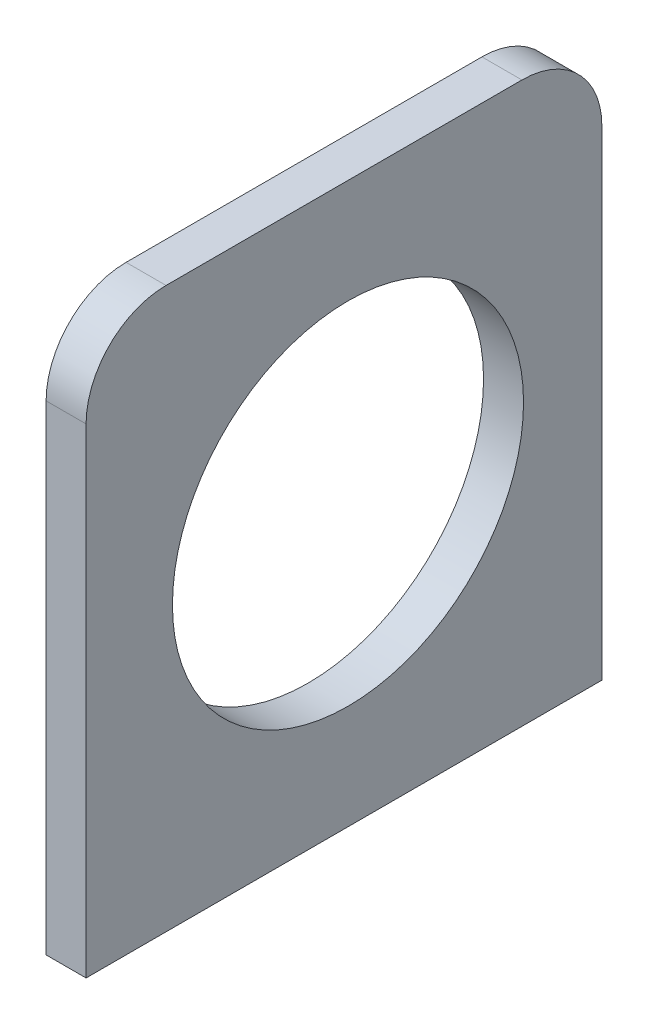
ISO-10303-21;
HEADER;
FILE_DESCRIPTION(('STEP AP214'),'2;1');
FILE_NAME('part.step','',(''),(''),'','','');
FILE_SCHEMA(('AUTOMOTIVE_DESIGN { 1 0 10303 214 1 1 1 1 }'));
ENDSEC;
DATA;
#1=APPLICATION_CONTEXT('core data for automotive mechanical design processes');
#2=APPLICATION_PROTOCOL_DEFINITION('international standard','automotive_design',2000,#1);
#3=PRODUCT_CONTEXT('',#1,'mechanical');
#4=PRODUCT('Part','Part','',(#3));
#5=PRODUCT_RELATED_PRODUCT_CATEGORY('part','',(#4));
#6=PRODUCT_DEFINITION_FORMATION('','',#4);
#7=PRODUCT_DEFINITION_CONTEXT('part definition',#1,'design');
#8=PRODUCT_DEFINITION('design','',#6,#7);
#9=PRODUCT_DEFINITION_SHAPE('','',#8);
#10=(LENGTH_UNIT() NAMED_UNIT(*) SI_UNIT(.MILLI.,.METRE.));
#11=(NAMED_UNIT(*) PLANE_ANGLE_UNIT() SI_UNIT($,.RADIAN.));
#12=(NAMED_UNIT(*) SI_UNIT($,.STERADIAN.) SOLID_ANGLE_UNIT());
#13=UNCERTAINTY_MEASURE_WITH_UNIT(LENGTH_MEASURE(1.E-05),#10,'distance_accuracy_value','');
#14=(GEOMETRIC_REPRESENTATION_CONTEXT(3) GLOBAL_UNCERTAINTY_ASSIGNED_CONTEXT((#13)) GLOBAL_UNIT_ASSIGNED_CONTEXT((#10,
#11,#12)) REPRESENTATION_CONTEXT('',''));
#15=CARTESIAN_POINT('',(0.,0.,0.));
#16=DIRECTION('',(0.,0.,1.));
#17=DIRECTION('',(1.,0.,0.));
#18=AXIS2_PLACEMENT_3D('',#15,#16,#17);
#19=CARTESIAN_POINT('',(-2.76315789473684,-62.8618421052632,64.5));
#20=DIRECTION('',(1.,0.,0.));
#21=DIRECTION('',(0.,1.,0.));
#22=AXIS2_PLACEMENT_3D('',#19,#20,#21);
#23=PLANE('',#22);
#24=CARTESIAN_POINT('',(-2.76315789473684,-27.8618421052632,31.75));
#25=DIRECTION('',(-1.,0.,0.));
#26=DIRECTION('',(0.,-1.,0.));
#27=AXIS2_PLACEMENT_3D('',#24,#25,#26);
#28=CIRCLE('',#27,21.9509271);
#29=CARTESIAN_POINT('',(-2.76315789473684,-49.8127692052632,31.75));
#30=VERTEX_POINT('',#29);
#31=EDGE_CURVE('E164',#30,#30,#28,.T.);
#32=ORIENTED_EDGE('',*,*,#31,.F.);
#33=EDGE_LOOP('',(#32));
#34=FACE_BOUND('',#33,.T.);
#35=DIRECTION('',(0.,0.,-1.));
#36=VECTOR('',#35,1.);
#37=CARTESIAN_POINT('',(-2.76315789473684,7.13815789473684,64.5));
#38=LINE('',#37,#36);
#39=CARTESIAN_POINT('',(-2.76315789473684,7.13815789473684,54.5));
#40=VERTEX_POINT('',#39);
#41=CARTESIAN_POINT('',(-2.76315789473684,7.13815789473684,10.));
#42=VERTEX_POINT('',#41);
#43=EDGE_CURVE('E146',#40,#42,#38,.T.);
#44=ORIENTED_EDGE('',*,*,#43,.T.);
#45=CARTESIAN_POINT('',(-2.76315789473684,-2.86184210526316,10.));
#46=DIRECTION('',(1.,0.,0.));
#47=DIRECTION('',(0.,1.,0.));
#48=AXIS2_PLACEMENT_3D('',#45,#46,#47);
#49=CIRCLE('',#48,10.);
#50=CARTESIAN_POINT('',(-2.76315789473684,-2.86184210526316,0.));
#51=VERTEX_POINT('',#50);
#52=EDGE_CURVE('E62',#42,#51,#49,.F.);
#53=ORIENTED_EDGE('',*,*,#52,.T.);
#54=DIRECTION('',(0.,-1.,0.));
#55=VECTOR('',#54,1.);
#56=CARTESIAN_POINT('',(-2.76315789473684,-62.8618421052632,0.));
#57=LINE('',#56,#55);
#58=CARTESIAN_POINT('',(-2.76315789473684,-62.8618421052632,0.));
#59=VERTEX_POINT('',#58);
#60=EDGE_CURVE('E114',#51,#59,#57,.T.);
#61=ORIENTED_EDGE('',*,*,#60,.T.);
#62=DIRECTION('',(0.,0.,-1.));
#63=VECTOR('',#62,1.);
#64=CARTESIAN_POINT('',(-2.76315789473684,-62.8618421052632,64.5));
#65=LINE('',#64,#63);
#66=CARTESIAN_POINT('',(-2.76315789473684,-62.8618421052632,64.5));
#67=VERTEX_POINT('',#66);
#68=EDGE_CURVE('E107',#67,#59,#65,.T.);
#69=ORIENTED_EDGE('',*,*,#68,.F.);
#70=DIRECTION('',(0.,-1.,0.));
#71=VECTOR('',#70,1.);
#72=CARTESIAN_POINT('',(-2.76315789473684,-62.8618421052632,64.5));
#73=LINE('',#72,#71);
#74=CARTESIAN_POINT('',(-2.76315789473684,-2.86184210526316,64.5));
#75=VERTEX_POINT('',#74);
#76=EDGE_CURVE('E92',#75,#67,#73,.T.);
#77=ORIENTED_EDGE('',*,*,#76,.F.);
#78=CARTESIAN_POINT('',(-2.76315789473684,-2.86184210526316,54.5));
#79=DIRECTION('',(1.,0.,0.));
#80=DIRECTION('',(0.,1.,0.));
#81=AXIS2_PLACEMENT_3D('',#78,#79,#80);
#82=CIRCLE('',#81,10.);
#83=EDGE_CURVE('E120',#75,#40,#82,.F.);
#84=ORIENTED_EDGE('',*,*,#83,.T.);
#85=EDGE_LOOP('',(#44,#53,#61,#69,#77,#84));
#86=FACE_BOUND('',#85,.T.);
#87=ADVANCED_FACE('F38',(#34,#86),#23,.F.);
#88=CARTESIAN_POINT('',(2.23684210526317,-62.8618421052632,64.5));
#89=DIRECTION('',(0.,1.,0.));
#90=DIRECTION('',(0.,0.,1.));
#91=AXIS2_PLACEMENT_3D('',#88,#89,#90);
#92=PLANE('',#91);
#93=DIRECTION('',(1.,0.,0.));
#94=VECTOR('',#93,1.);
#95=CARTESIAN_POINT('',(2.23684210526317,-62.8618421052632,0.));
#96=LINE('',#95,#94);
#97=CARTESIAN_POINT('',(2.23684210526317,-62.8618421052632,0.));
#98=VERTEX_POINT('',#97);
#99=EDGE_CURVE('E159',#59,#98,#96,.T.);
#100=ORIENTED_EDGE('',*,*,#99,.T.);
#101=DIRECTION('',(0.,0.,-1.));
#102=VECTOR('',#101,1.);
#103=CARTESIAN_POINT('',(2.23684210526317,-62.8618421052632,64.5));
#104=LINE('',#103,#102);
#105=CARTESIAN_POINT('',(2.23684210526317,-62.8618421052632,64.5));
#106=VERTEX_POINT('',#105);
#107=EDGE_CURVE('E109',#106,#98,#104,.T.);
#108=ORIENTED_EDGE('',*,*,#107,.F.);
#109=DIRECTION('',(1.,0.,0.));
#110=VECTOR('',#109,1.);
#111=CARTESIAN_POINT('',(2.23684210526317,-62.8618421052632,64.5));
#112=LINE('',#111,#110);
#113=EDGE_CURVE('E96',#67,#106,#112,.T.);
#114=ORIENTED_EDGE('',*,*,#113,.F.);
#115=ORIENTED_EDGE('',*,*,#68,.T.);
#116=EDGE_LOOP('',(#100,#108,#114,#115));
#117=FACE_BOUND('',#116,.T.);
#118=ADVANCED_FACE('F106',(#117),#92,.F.);
#119=CARTESIAN_POINT('',(2.23684210526316,7.13815789473684,64.5));
#120=DIRECTION('',(-1.,0.,0.));
#121=DIRECTION('',(0.,-1.,0.));
#122=AXIS2_PLACEMENT_3D('',#119,#120,#121);
#123=PLANE('',#122);
#124=CARTESIAN_POINT('',(2.23684210526316,-27.8618421052632,31.75));
#125=DIRECTION('',(-1.,0.,0.));
#126=DIRECTION('',(0.,-1.,0.));
#127=AXIS2_PLACEMENT_3D('',#124,#125,#126);
#128=CIRCLE('',#127,21.9509271);
#129=CARTESIAN_POINT('',(2.23684210526317,-49.8127692052632,31.75));
#130=VERTEX_POINT('',#129);
#131=EDGE_CURVE('E42',#130,#130,#128,.T.);
#132=ORIENTED_EDGE('',*,*,#131,.T.);
#133=EDGE_LOOP('',(#132));
#134=FACE_BOUND('',#133,.T.);
#135=DIRECTION('',(0.,1.,0.));
#136=VECTOR('',#135,1.);
#137=CARTESIAN_POINT('',(2.23684210526316,7.13815789473684,0.));
#138=LINE('',#137,#136);
#139=CARTESIAN_POINT('',(2.23684210526316,-2.86184210526316,0.));
#140=VERTEX_POINT('',#139);
#141=EDGE_CURVE('E102',#98,#140,#138,.T.);
#142=ORIENTED_EDGE('',*,*,#141,.T.);
#143=CARTESIAN_POINT('',(2.23684210526316,-2.86184210526316,10.));
#144=DIRECTION('',(-1.,0.,0.));
#145=DIRECTION('',(0.,-1.,0.));
#146=AXIS2_PLACEMENT_3D('',#143,#144,#145);
#147=CIRCLE('',#146,10.);
#148=CARTESIAN_POINT('',(2.23684210526316,7.13815789473684,10.));
#149=VERTEX_POINT('',#148);
#150=EDGE_CURVE('E11',#140,#149,#147,.F.);
#151=ORIENTED_EDGE('',*,*,#150,.T.);
#152=DIRECTION('',(0.,0.,-1.));
#153=VECTOR('',#152,1.);
#154=CARTESIAN_POINT('',(2.23684210526316,7.13815789473684,64.5));
#155=LINE('',#154,#153);
#156=CARTESIAN_POINT('',(2.23684210526316,7.13815789473684,54.5));
#157=VERTEX_POINT('',#156);
#158=EDGE_CURVE('E122',#157,#149,#155,.T.);
#159=ORIENTED_EDGE('',*,*,#158,.F.);
#160=CARTESIAN_POINT('',(2.23684210526316,-2.86184210526316,54.5));
#161=DIRECTION('',(-1.,0.,0.));
#162=DIRECTION('',(0.,-1.,0.));
#163=AXIS2_PLACEMENT_3D('',#160,#161,#162);
#164=CIRCLE('',#163,10.);
#165=CARTESIAN_POINT('',(2.23684210526316,-2.86184210526316,64.5));
#166=VERTEX_POINT('',#165);
#167=EDGE_CURVE('E131',#157,#166,#164,.F.);
#168=ORIENTED_EDGE('',*,*,#167,.T.);
#169=DIRECTION('',(0.,1.,0.));
#170=VECTOR('',#169,1.);
#171=CARTESIAN_POINT('',(2.23684210526316,7.13815789473684,64.5));
#172=LINE('',#171,#170);
#173=EDGE_CURVE('E112',#106,#166,#172,.T.);
#174=ORIENTED_EDGE('',*,*,#173,.F.);
#175=ORIENTED_EDGE('',*,*,#107,.T.);
#176=EDGE_LOOP('',(#142,#151,#159,#168,#174,#175));
#177=FACE_BOUND('',#176,.T.);
#178=ADVANCED_FACE('F173',(#134,#177),#123,.F.);
#179=CARTESIAN_POINT('',(-2.76315789473684,7.13815789473684,64.5));
#180=DIRECTION('',(0.,-1.,0.));
#181=DIRECTION('',(0.,0.,-1.));
#182=AXIS2_PLACEMENT_3D('',#179,#180,#181);
#183=PLANE('',#182);
#184=ORIENTED_EDGE('',*,*,#158,.T.);
#185=DIRECTION('',(-1.,0.,0.));
#186=VECTOR('',#185,1.);
#187=CARTESIAN_POINT('',(-2.76315789473684,7.13815789473684,10.));
#188=LINE('',#187,#186);
#189=EDGE_CURVE('E134',#149,#42,#188,.T.);
#190=ORIENTED_EDGE('',*,*,#189,.T.);
#191=ORIENTED_EDGE('',*,*,#43,.F.);
#192=DIRECTION('',(-1.,0.,0.));
#193=VECTOR('',#192,1.);
#194=CARTESIAN_POINT('',(-2.76315789473684,7.13815789473684,54.5));
#195=LINE('',#194,#193);
#196=EDGE_CURVE('E128',#40,#157,#195,.F.);
#197=ORIENTED_EDGE('',*,*,#196,.T.);
#198=EDGE_LOOP('',(#184,#190,#191,#197));
#199=FACE_BOUND('',#198,.T.);
#200=ADVANCED_FACE('F145',(#199),#183,.F.);
#201=CARTESIAN_POINT('',(0.,0.,64.5));
#202=DIRECTION('',(0.,0.,-1.));
#203=DIRECTION('',(-1.,0.,0.));
#204=AXIS2_PLACEMENT_3D('',#201,#202,#203);
#205=PLANE('',#204);
#206=ORIENTED_EDGE('',*,*,#173,.T.);
#207=DIRECTION('',(-1.,0.,0.));
#208=VECTOR('',#207,1.);
#209=CARTESIAN_POINT('',(0.,-2.86184210526316,64.5));
#210=LINE('',#209,#208);
#211=EDGE_CURVE('E99',#166,#75,#210,.T.);
#212=ORIENTED_EDGE('',*,*,#211,.T.);
#213=ORIENTED_EDGE('',*,*,#76,.T.);
#214=ORIENTED_EDGE('',*,*,#113,.T.);
#215=EDGE_LOOP('',(#206,#212,#213,#214));
#216=FACE_BOUND('',#215,.T.);
#217=ADVANCED_FACE('F95',(#216),#205,.F.);
#218=CARTESIAN_POINT('',(0.,0.,0.));
#219=DIRECTION('',(0.,0.,-1.));
#220=DIRECTION('',(-1.,0.,0.));
#221=AXIS2_PLACEMENT_3D('',#218,#219,#220);
#222=PLANE('',#221);
#223=ORIENTED_EDGE('',*,*,#60,.F.);
#224=DIRECTION('',(-1.,0.,0.));
#225=VECTOR('',#224,1.);
#226=CARTESIAN_POINT('',(2.23684210526316,-2.86184210526316,0.));
#227=LINE('',#226,#225);
#228=EDGE_CURVE('E48',#51,#140,#227,.F.);
#229=ORIENTED_EDGE('',*,*,#228,.T.);
#230=ORIENTED_EDGE('',*,*,#141,.F.);
#231=ORIENTED_EDGE('',*,*,#99,.F.);
#232=EDGE_LOOP('',(#223,#229,#230,#231));
#233=FACE_BOUND('',#232,.T.);
#234=ADVANCED_FACE('F193',(#233),#222,.T.);
#235=CARTESIAN_POINT('',(0.,-2.86184210526316,54.5));
#236=DIRECTION('',(-1.,0.,0.));
#237=DIRECTION('',(0.,0.,1.));
#238=AXIS2_PLACEMENT_3D('',#235,#236,#237);
#239=CYLINDRICAL_SURFACE('',#238,10.);
#240=ORIENTED_EDGE('',*,*,#167,.F.);
#241=ORIENTED_EDGE('',*,*,#196,.F.);
#242=ORIENTED_EDGE('',*,*,#83,.F.);
#243=ORIENTED_EDGE('',*,*,#211,.F.);
#244=EDGE_LOOP('',(#240,#241,#242,#243));
#245=FACE_BOUND('',#244,.T.);
#246=ADVANCED_FACE('F182',(#245),#239,.T.);
#247=CARTESIAN_POINT('',(-2.76315789473684,-2.86184210526316,10.));
#248=DIRECTION('',(1.,0.,0.));
#249=DIRECTION('',(0.,0.,-1.));
#250=AXIS2_PLACEMENT_3D('',#247,#248,#249);
#251=CYLINDRICAL_SURFACE('',#250,10.);
#252=ORIENTED_EDGE('',*,*,#150,.F.);
#253=ORIENTED_EDGE('',*,*,#228,.F.);
#254=ORIENTED_EDGE('',*,*,#52,.F.);
#255=ORIENTED_EDGE('',*,*,#189,.F.);
#256=EDGE_LOOP('',(#252,#253,#254,#255));
#257=FACE_BOUND('',#256,.T.);
#258=ADVANCED_FACE('F40',(#257),#251,.T.);
#259=CARTESIAN_POINT('',(7.23684210526316,-27.8618421052632,31.75));
#260=DIRECTION('',(-1.,0.,0.));
#261=DIRECTION('',(0.,-1.,0.));
#262=AXIS2_PLACEMENT_3D('',#259,#260,#261);
#263=CYLINDRICAL_SURFACE('',#262,21.9509271);
#264=ORIENTED_EDGE('',*,*,#31,.T.);
#265=EDGE_LOOP('',(#264));
#266=FACE_BOUND('',#265,.T.);
#267=ORIENTED_EDGE('',*,*,#131,.F.);
#268=EDGE_LOOP('',(#267));
#269=FACE_BOUND('',#268,.T.);
#270=ADVANCED_FACE('F176',(#266,#269),#263,.F.);
#271=CLOSED_SHELL('',(#87,#118,#178,#200,#217,#234,#246,#258,#270));
#272=MANIFOLD_SOLID_BREP('B2',#271);
#273=ADVANCED_BREP_SHAPE_REPRESENTATION('',(#18,#272),#14);
#274=SHAPE_DEFINITION_REPRESENTATION(#9,#273);
ENDSEC;
END-ISO-10303-21;
